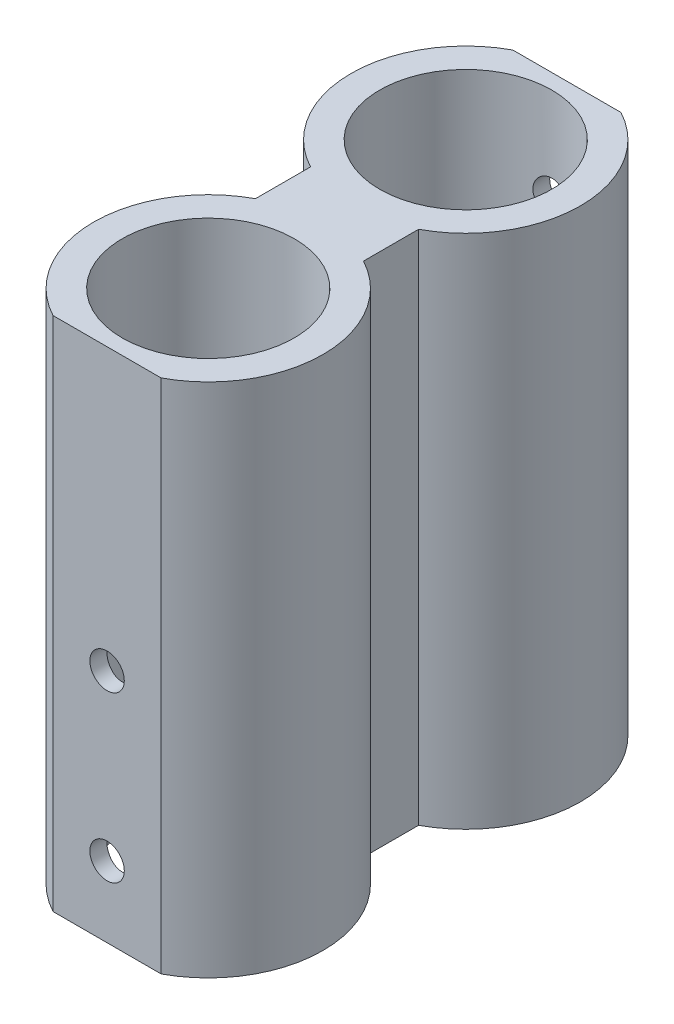
ISO-10303-21;
HEADER;
FILE_DESCRIPTION(('STEP AP214'),'2;1');
FILE_NAME('part.step','',(''),(''),'','','');
FILE_SCHEMA(('AUTOMOTIVE_DESIGN { 1 0 10303 214 1 1 1 1 }'));
ENDSEC;
DATA;
#1=APPLICATION_CONTEXT('core data for automotive mechanical design processes');
#2=APPLICATION_PROTOCOL_DEFINITION('international standard','automotive_design',2000,#1);
#3=PRODUCT_CONTEXT('',#1,'mechanical');
#4=PRODUCT('Part','Part','',(#3));
#5=PRODUCT_RELATED_PRODUCT_CATEGORY('part','',(#4));
#6=PRODUCT_DEFINITION_FORMATION('','',#4);
#7=PRODUCT_DEFINITION_CONTEXT('part definition',#1,'design');
#8=PRODUCT_DEFINITION('design','',#6,#7);
#9=PRODUCT_DEFINITION_SHAPE('','',#8);
#10=(LENGTH_UNIT() NAMED_UNIT(*) SI_UNIT(.MILLI.,.METRE.));
#11=(NAMED_UNIT(*) PLANE_ANGLE_UNIT() SI_UNIT($,.RADIAN.));
#12=(NAMED_UNIT(*) SI_UNIT($,.STERADIAN.) SOLID_ANGLE_UNIT());
#13=UNCERTAINTY_MEASURE_WITH_UNIT(LENGTH_MEASURE(1.E-05),#10,'distance_accuracy_value','');
#14=(GEOMETRIC_REPRESENTATION_CONTEXT(3) GLOBAL_UNCERTAINTY_ASSIGNED_CONTEXT((#13)) GLOBAL_UNIT_ASSIGNED_CONTEXT((#10,
#11,#12)) REPRESENTATION_CONTEXT('',''));
#15=CARTESIAN_POINT('',(0.,0.,0.));
#16=DIRECTION('',(0.,0.,1.));
#17=DIRECTION('',(1.,0.,0.));
#18=AXIS2_PLACEMENT_3D('',#15,#16,#17);
#19=CARTESIAN_POINT('',(0.,45.,0.));
#20=DIRECTION('',(0.,-1.,0.));
#21=DIRECTION('',(0.,0.,-1.));
#22=AXIS2_PLACEMENT_3D('',#19,#20,#21);
#23=CYLINDRICAL_SURFACE('',#22,10.);
#24=CARTESIAN_POINT('',(0.,0.,0.));
#25=DIRECTION('',(0.,1.,0.));
#26=DIRECTION('',(0.,0.,1.));
#27=AXIS2_PLACEMENT_3D('',#24,#25,#26);
#28=CIRCLE('',#27,10.);
#29=CARTESIAN_POINT('',(4.71094618747117,0.,8.82082683305544));
#30=VERTEX_POINT('',#29);
#31=CARTESIAN_POINT('',(4.71094618747117,0.,-8.82082683305544));
#32=VERTEX_POINT('',#31);
#33=EDGE_CURVE('E150',#30,#32,#28,.T.);
#34=ORIENTED_EDGE('',*,*,#33,.T.);
#35=DIRECTION('',(0.,-1.,0.));
#36=VECTOR('',#35,1.);
#37=CARTESIAN_POINT('',(4.71094618747117,45.,-8.82082683305544));
#38=LINE('',#37,#36);
#39=CARTESIAN_POINT('',(4.71094618747117,45.,-8.82082683305544));
#40=VERTEX_POINT('',#39);
#41=EDGE_CURVE('E11',#40,#32,#38,.T.);
#42=ORIENTED_EDGE('',*,*,#41,.F.);
#43=CARTESIAN_POINT('',(0.,45.,0.));
#44=DIRECTION('',(0.,1.,0.));
#45=DIRECTION('',(0.,0.,1.));
#46=AXIS2_PLACEMENT_3D('',#43,#44,#45);
#47=CIRCLE('',#46,10.);
#48=CARTESIAN_POINT('',(4.71094618747117,45.,8.82082683305544));
#49=VERTEX_POINT('',#48);
#50=EDGE_CURVE('E173',#49,#40,#47,.T.);
#51=ORIENTED_EDGE('',*,*,#50,.F.);
#52=DIRECTION('',(0.,-1.,0.));
#53=VECTOR('',#52,1.);
#54=CARTESIAN_POINT('',(4.71094618747117,45.,8.82082683305544));
#55=LINE('',#54,#53);
#56=EDGE_CURVE('E146',#49,#30,#55,.T.);
#57=ORIENTED_EDGE('',*,*,#56,.T.);
#58=EDGE_LOOP('',(#34,#42,#51,#57));
#59=FACE_BOUND('',#58,.T.);
#60=ADVANCED_FACE('F42',(#59),#23,.T.);
#61=CARTESIAN_POINT('',(-4.71094618747118,45.,-8.82082683305543));
#62=DIRECTION('',(0.,0.,1.));
#63=DIRECTION('',(1.,0.,0.));
#64=AXIS2_PLACEMENT_3D('',#61,#62,#63);
#65=PLANE('',#64);
#66=CARTESIAN_POINT('',(0.,36.8523920653444,-8.82082683305544));
#67=DIRECTION('',(0.,0.,-1.));
#68=DIRECTION('',(-1.,0.,0.));
#69=AXIS2_PLACEMENT_3D('',#66,#67,#68);
#70=CIRCLE('',#69,1.5);
#71=CARTESIAN_POINT('',(-1.5,36.8523920653444,-8.82082683305544));
#72=VERTEX_POINT('',#71);
#73=EDGE_CURVE('E279',#72,#72,#70,.T.);
#74=ORIENTED_EDGE('',*,*,#73,.F.);
#75=EDGE_LOOP('',(#74));
#76=FACE_BOUND('',#75,.T.);
#77=DIRECTION('',(-1.,0.,0.));
#78=VECTOR('',#77,1.);
#79=CARTESIAN_POINT('',(-4.71094618747118,0.,-8.82082683305543));
#80=LINE('',#79,#78);
#81=CARTESIAN_POINT('',(-4.71094618747118,0.,-8.82082683305543));
#82=VERTEX_POINT('',#81);
#83=EDGE_CURVE('E154',#32,#82,#80,.T.);
#84=ORIENTED_EDGE('',*,*,#83,.T.);
#85=DIRECTION('',(0.,-1.,0.));
#86=VECTOR('',#85,1.);
#87=CARTESIAN_POINT('',(-4.71094618747118,45.,-8.82082683305543));
#88=LINE('',#87,#86);
#89=CARTESIAN_POINT('',(-4.71094618747118,45.,-8.82082683305543));
#90=VERTEX_POINT('',#89);
#91=EDGE_CURVE('E57',#90,#82,#88,.T.);
#92=ORIENTED_EDGE('',*,*,#91,.F.);
#93=DIRECTION('',(-1.,0.,0.));
#94=VECTOR('',#93,1.);
#95=CARTESIAN_POINT('',(-4.71094618747118,45.,-8.82082683305543));
#96=LINE('',#95,#94);
#97=EDGE_CURVE('E109',#40,#90,#96,.T.);
#98=ORIENTED_EDGE('',*,*,#97,.F.);
#99=ORIENTED_EDGE('',*,*,#41,.T.);
#100=EDGE_LOOP('',(#84,#92,#98,#99));
#101=FACE_BOUND('',#100,.T.);
#102=ADVANCED_FACE('F236',(#76,#101),#65,.F.);
#103=CARTESIAN_POINT('',(0.,45.,0.));
#104=DIRECTION('',(0.,-1.,0.));
#105=DIRECTION('',(0.,0.,-1.));
#106=AXIS2_PLACEMENT_3D('',#103,#104,#105);
#107=CYLINDRICAL_SURFACE('',#106,10.);
#108=CARTESIAN_POINT('',(0.,0.,0.));
#109=DIRECTION('',(0.,1.,0.));
#110=DIRECTION('',(0.,0.,1.));
#111=AXIS2_PLACEMENT_3D('',#108,#109,#110);
#112=CIRCLE('',#111,10.);
#113=CARTESIAN_POINT('',(-4.71094618747117,0.,8.82082683305544));
#114=VERTEX_POINT('',#113);
#115=EDGE_CURVE('E158',#82,#114,#112,.T.);
#116=ORIENTED_EDGE('',*,*,#115,.T.);
#117=DIRECTION('',(0.,-1.,0.));
#118=VECTOR('',#117,1.);
#119=CARTESIAN_POINT('',(-4.71094618747117,45.,8.82082683305544));
#120=LINE('',#119,#118);
#121=CARTESIAN_POINT('',(-4.71094618747117,45.,8.82082683305544));
#122=VERTEX_POINT('',#121);
#123=EDGE_CURVE('E184',#122,#114,#120,.T.);
#124=ORIENTED_EDGE('',*,*,#123,.F.);
#125=CARTESIAN_POINT('',(0.,45.,0.));
#126=DIRECTION('',(0.,1.,0.));
#127=DIRECTION('',(0.,0.,1.));
#128=AXIS2_PLACEMENT_3D('',#125,#126,#127);
#129=CIRCLE('',#128,10.);
#130=EDGE_CURVE('E252',#90,#122,#129,.T.);
#131=ORIENTED_EDGE('',*,*,#130,.F.);
#132=ORIENTED_EDGE('',*,*,#91,.T.);
#133=EDGE_LOOP('',(#116,#124,#131,#132));
#134=FACE_BOUND('',#133,.T.);
#135=ADVANCED_FACE('F241',(#134),#107,.T.);
#136=CARTESIAN_POINT('',(-4.71094618747118,45.,8.82082683305544));
#137=DIRECTION('',(1.,0.,0.));
#138=DIRECTION('',(0.,0.,-1.));
#139=AXIS2_PLACEMENT_3D('',#136,#137,#138);
#140=PLANE('',#139);
#141=DIRECTION('',(0.,0.,1.));
#142=VECTOR('',#141,1.);
#143=CARTESIAN_POINT('',(-4.71094618747118,0.,8.82082683305544));
#144=LINE('',#143,#142);
#145=CARTESIAN_POINT('',(-4.71094618747118,0.,13.6270898336112));
#146=VERTEX_POINT('',#145);
#147=EDGE_CURVE('E161',#114,#146,#144,.T.);
#148=ORIENTED_EDGE('',*,*,#147,.T.);
#149=DIRECTION('',(0.,-1.,0.));
#150=VECTOR('',#149,1.);
#151=CARTESIAN_POINT('',(-4.71094618747118,45.,13.6270898336112));
#152=LINE('',#151,#150);
#153=CARTESIAN_POINT('',(-4.71094618747118,45.,13.6270898336112));
#154=VERTEX_POINT('',#153);
#155=EDGE_CURVE('E180',#154,#146,#152,.T.);
#156=ORIENTED_EDGE('',*,*,#155,.F.);
#157=DIRECTION('',(0.,0.,1.));
#158=VECTOR('',#157,1.);
#159=CARTESIAN_POINT('',(-4.71094618747118,45.,8.82082683305544));
#160=LINE('',#159,#158);
#161=EDGE_CURVE('E255',#122,#154,#160,.T.);
#162=ORIENTED_EDGE('',*,*,#161,.F.);
#163=ORIENTED_EDGE('',*,*,#123,.T.);
#164=EDGE_LOOP('',(#148,#156,#162,#163));
#165=FACE_BOUND('',#164,.T.);
#166=ADVANCED_FACE('F326',(#165),#140,.F.);
#167=CARTESIAN_POINT('',(0.,45.,22.4479166666667));
#168=DIRECTION('',(0.,-1.,0.));
#169=DIRECTION('',(0.,0.,-1.));
#170=AXIS2_PLACEMENT_3D('',#167,#168,#169);
#171=CYLINDRICAL_SURFACE('',#170,10.);
#172=CARTESIAN_POINT('',(0.,0.,22.4479166666667));
#173=DIRECTION('',(0.,1.,0.));
#174=DIRECTION('',(0.,0.,1.));
#175=AXIS2_PLACEMENT_3D('',#172,#173,#174);
#176=CIRCLE('',#175,10.);
#177=CARTESIAN_POINT('',(-4.71094618747118,0.,31.2687434997221));
#178=VERTEX_POINT('',#177);
#179=EDGE_CURVE('E164',#146,#178,#176,.T.);
#180=ORIENTED_EDGE('',*,*,#179,.T.);
#181=DIRECTION('',(0.,-1.,0.));
#182=VECTOR('',#181,1.);
#183=CARTESIAN_POINT('',(-4.71094618747118,45.,31.2687434997221));
#184=LINE('',#183,#182);
#185=CARTESIAN_POINT('',(-4.71094618747118,45.,31.2687434997221));
#186=VERTEX_POINT('',#185);
#187=EDGE_CURVE('E139',#186,#178,#184,.T.);
#188=ORIENTED_EDGE('',*,*,#187,.F.);
#189=CARTESIAN_POINT('',(0.,45.,22.4479166666667));
#190=DIRECTION('',(0.,1.,0.));
#191=DIRECTION('',(0.,0.,1.));
#192=AXIS2_PLACEMENT_3D('',#189,#190,#191);
#193=CIRCLE('',#192,10.);
#194=EDGE_CURVE('E128',#154,#186,#193,.T.);
#195=ORIENTED_EDGE('',*,*,#194,.F.);
#196=ORIENTED_EDGE('',*,*,#155,.T.);
#197=EDGE_LOOP('',(#180,#188,#195,#196));
#198=FACE_BOUND('',#197,.T.);
#199=ADVANCED_FACE('F322',(#198),#171,.T.);
#200=CARTESIAN_POINT('',(-4.71094618747118,45.,31.2687434997221));
#201=DIRECTION('',(0.,0.,-1.));
#202=DIRECTION('',(-1.,0.,0.));
#203=AXIS2_PLACEMENT_3D('',#200,#201,#202);
#204=PLANE('',#203);
#205=CARTESIAN_POINT('',(0.,20.5326938145444,31.2687434997221));
#206=DIRECTION('',(0.,0.,1.));
#207=DIRECTION('',(1.,0.,0.));
#208=AXIS2_PLACEMENT_3D('',#205,#206,#207);
#209=CIRCLE('',#208,1.5);
#210=CARTESIAN_POINT('',(1.5,20.5326938145444,31.2687434997221));
#211=VERTEX_POINT('',#210);
#212=EDGE_CURVE('E208',#211,#211,#209,.T.);
#213=ORIENTED_EDGE('',*,*,#212,.F.);
#214=EDGE_LOOP('',(#213));
#215=FACE_BOUND('',#214,.T.);
#216=CARTESIAN_POINT('',(0.,6.1789456150971,31.2687434997221));
#217=DIRECTION('',(0.,0.,1.));
#218=DIRECTION('',(1.,0.,0.));
#219=AXIS2_PLACEMENT_3D('',#216,#217,#218);
#220=CIRCLE('',#219,1.5);
#221=CARTESIAN_POINT('',(1.5,6.1789456150971,31.2687434997221));
#222=VERTEX_POINT('',#221);
#223=EDGE_CURVE('E272',#222,#222,#220,.T.);
#224=ORIENTED_EDGE('',*,*,#223,.F.);
#225=EDGE_LOOP('',(#224));
#226=FACE_BOUND('',#225,.T.);
#227=DIRECTION('',(1.,0.,0.));
#228=VECTOR('',#227,1.);
#229=CARTESIAN_POINT('',(-4.71094618747118,0.,31.2687434997221));
#230=LINE('',#229,#228);
#231=CARTESIAN_POINT('',(4.71094618747117,0.,31.2687434997221));
#232=VERTEX_POINT('',#231);
#233=EDGE_CURVE('E137',#178,#232,#230,.T.);
#234=ORIENTED_EDGE('',*,*,#233,.T.);
#235=DIRECTION('',(0.,-1.,0.));
#236=VECTOR('',#235,1.);
#237=CARTESIAN_POINT('',(4.71094618747117,45.,31.2687434997221));
#238=LINE('',#237,#236);
#239=CARTESIAN_POINT('',(4.71094618747117,45.,31.2687434997221));
#240=VERTEX_POINT('',#239);
#241=EDGE_CURVE('E134',#240,#232,#238,.T.);
#242=ORIENTED_EDGE('',*,*,#241,.F.);
#243=DIRECTION('',(1.,0.,0.));
#244=VECTOR('',#243,1.);
#245=CARTESIAN_POINT('',(-4.71094618747118,45.,31.2687434997221));
#246=LINE('',#245,#244);
#247=EDGE_CURVE('E122',#186,#240,#246,.T.);
#248=ORIENTED_EDGE('',*,*,#247,.F.);
#249=ORIENTED_EDGE('',*,*,#187,.T.);
#250=EDGE_LOOP('',(#234,#242,#248,#249));
#251=FACE_BOUND('',#250,.T.);
#252=ADVANCED_FACE('F135',(#215,#226,#251),#204,.F.);
#253=CARTESIAN_POINT('',(0.,45.,22.4479166666667));
#254=DIRECTION('',(0.,-1.,0.));
#255=DIRECTION('',(0.,0.,-1.));
#256=AXIS2_PLACEMENT_3D('',#253,#254,#255);
#257=CYLINDRICAL_SURFACE('',#256,10.);
#258=CARTESIAN_POINT('',(0.,0.,22.4479166666667));
#259=DIRECTION('',(0.,1.,0.));
#260=DIRECTION('',(0.,0.,1.));
#261=AXIS2_PLACEMENT_3D('',#258,#259,#260);
#262=CIRCLE('',#261,10.);
#263=CARTESIAN_POINT('',(4.71094618747117,0.,13.6270898336112));
#264=VERTEX_POINT('',#263);
#265=EDGE_CURVE('E95',#232,#264,#262,.T.);
#266=ORIENTED_EDGE('',*,*,#265,.T.);
#267=DIRECTION('',(0.,-1.,0.));
#268=VECTOR('',#267,1.);
#269=CARTESIAN_POINT('',(4.71094618747117,45.,13.6270898336112));
#270=LINE('',#269,#268);
#271=CARTESIAN_POINT('',(4.71094618747117,45.,13.6270898336112));
#272=VERTEX_POINT('',#271);
#273=EDGE_CURVE('E140',#272,#264,#270,.T.);
#274=ORIENTED_EDGE('',*,*,#273,.F.);
#275=CARTESIAN_POINT('',(0.,45.,22.4479166666667));
#276=DIRECTION('',(0.,1.,0.));
#277=DIRECTION('',(0.,0.,1.));
#278=AXIS2_PLACEMENT_3D('',#275,#276,#277);
#279=CIRCLE('',#278,10.);
#280=EDGE_CURVE('E126',#240,#272,#279,.T.);
#281=ORIENTED_EDGE('',*,*,#280,.F.);
#282=ORIENTED_EDGE('',*,*,#241,.T.);
#283=EDGE_LOOP('',(#266,#274,#281,#282));
#284=FACE_BOUND('',#283,.T.);
#285=ADVANCED_FACE('F142',(#284),#257,.T.);
#286=CARTESIAN_POINT('',(4.71094618747117,45.,8.82082683305544));
#287=DIRECTION('',(-1.,0.,0.));
#288=DIRECTION('',(0.,0.,1.));
#289=AXIS2_PLACEMENT_3D('',#286,#287,#288);
#290=PLANE('',#289);
#291=DIRECTION('',(0.,0.,-1.));
#292=VECTOR('',#291,1.);
#293=CARTESIAN_POINT('',(4.71094618747117,0.,8.82082683305544));
#294=LINE('',#293,#292);
#295=EDGE_CURVE('E101',#264,#30,#294,.T.);
#296=ORIENTED_EDGE('',*,*,#295,.T.);
#297=ORIENTED_EDGE('',*,*,#56,.F.);
#298=DIRECTION('',(0.,0.,-1.));
#299=VECTOR('',#298,1.);
#300=CARTESIAN_POINT('',(4.71094618747117,45.,8.82082683305544));
#301=LINE('',#300,#299);
#302=EDGE_CURVE('E66',#272,#49,#301,.T.);
#303=ORIENTED_EDGE('',*,*,#302,.F.);
#304=ORIENTED_EDGE('',*,*,#273,.T.);
#305=EDGE_LOOP('',(#296,#297,#303,#304));
#306=FACE_BOUND('',#305,.T.);
#307=ADVANCED_FACE('F313',(#306),#290,.F.);
#308=CARTESIAN_POINT('',(0.,45.,0.));
#309=DIRECTION('',(0.,1.,0.));
#310=DIRECTION('',(0.,0.,1.));
#311=AXIS2_PLACEMENT_3D('',#308,#309,#310);
#312=PLANE('',#311);
#313=CARTESIAN_POINT('',(0.,45.,0.));
#314=DIRECTION('',(0.,1.,0.));
#315=DIRECTION('',(0.,0.,1.));
#316=AXIS2_PLACEMENT_3D('',#313,#314,#315);
#317=CIRCLE('',#316,7.5);
#318=CARTESIAN_POINT('',(0.,45.,7.5));
#319=VERTEX_POINT('',#318);
#320=EDGE_CURVE('E195',#319,#319,#317,.T.);
#321=ORIENTED_EDGE('',*,*,#320,.F.);
#322=EDGE_LOOP('',(#321));
#323=FACE_BOUND('',#322,.T.);
#324=CARTESIAN_POINT('',(0.,45.,22.4479166666667));
#325=DIRECTION('',(0.,1.,0.));
#326=DIRECTION('',(0.,0.,1.));
#327=AXIS2_PLACEMENT_3D('',#324,#325,#326);
#328=CIRCLE('',#327,7.5);
#329=CARTESIAN_POINT('',(0.,45.,29.9479166666667));
#330=VERTEX_POINT('',#329);
#331=EDGE_CURVE('E265',#330,#330,#328,.T.);
#332=ORIENTED_EDGE('',*,*,#331,.F.);
#333=EDGE_LOOP('',(#332));
#334=FACE_BOUND('',#333,.T.);
#335=ORIENTED_EDGE('',*,*,#50,.T.);
#336=ORIENTED_EDGE('',*,*,#97,.T.);
#337=ORIENTED_EDGE('',*,*,#130,.T.);
#338=ORIENTED_EDGE('',*,*,#161,.T.);
#339=ORIENTED_EDGE('',*,*,#194,.T.);
#340=ORIENTED_EDGE('',*,*,#247,.T.);
#341=ORIENTED_EDGE('',*,*,#280,.T.);
#342=ORIENTED_EDGE('',*,*,#302,.T.);
#343=EDGE_LOOP('',(#335,#336,#337,#338,#339,#340,#341,#342));
#344=FACE_BOUND('',#343,.T.);
#345=ADVANCED_FACE('F124',(#323,#334,#344),#312,.T.);
#346=CARTESIAN_POINT('',(0.,0.,0.));
#347=DIRECTION('',(0.,1.,0.));
#348=DIRECTION('',(0.,0.,1.));
#349=AXIS2_PLACEMENT_3D('',#346,#347,#348);
#350=PLANE('',#349);
#351=CARTESIAN_POINT('',(0.,0.,0.));
#352=DIRECTION('',(0.,1.,0.));
#353=DIRECTION('',(0.,0.,1.));
#354=AXIS2_PLACEMENT_3D('',#351,#352,#353);
#355=CIRCLE('',#354,7.5);
#356=CARTESIAN_POINT('',(0.,0.,7.5));
#357=VERTEX_POINT('',#356);
#358=EDGE_CURVE('E155',#357,#357,#355,.T.);
#359=ORIENTED_EDGE('',*,*,#358,.T.);
#360=EDGE_LOOP('',(#359));
#361=FACE_BOUND('',#360,.T.);
#362=CARTESIAN_POINT('',(0.,0.,22.4479166666667));
#363=DIRECTION('',(0.,1.,0.));
#364=DIRECTION('',(0.,0.,1.));
#365=AXIS2_PLACEMENT_3D('',#362,#363,#364);
#366=CIRCLE('',#365,7.5);
#367=CARTESIAN_POINT('',(0.,0.,29.9479166666667));
#368=VERTEX_POINT('',#367);
#369=EDGE_CURVE('E191',#368,#368,#366,.T.);
#370=ORIENTED_EDGE('',*,*,#369,.T.);
#371=EDGE_LOOP('',(#370));
#372=FACE_BOUND('',#371,.T.);
#373=ORIENTED_EDGE('',*,*,#33,.F.);
#374=ORIENTED_EDGE('',*,*,#295,.F.);
#375=ORIENTED_EDGE('',*,*,#265,.F.);
#376=ORIENTED_EDGE('',*,*,#233,.F.);
#377=ORIENTED_EDGE('',*,*,#179,.F.);
#378=ORIENTED_EDGE('',*,*,#147,.F.);
#379=ORIENTED_EDGE('',*,*,#115,.F.);
#380=ORIENTED_EDGE('',*,*,#83,.F.);
#381=EDGE_LOOP('',(#373,#374,#375,#376,#377,#378,#379,#380));
#382=FACE_BOUND('',#381,.T.);
#383=ADVANCED_FACE('F231',(#361,#372,#382),#350,.F.);
#384=CARTESIAN_POINT('',(0.,-3.,22.4479166666667));
#385=DIRECTION('',(0.,1.,0.));
#386=DIRECTION('',(0.,0.,1.));
#387=AXIS2_PLACEMENT_3D('',#384,#385,#386);
#388=CYLINDRICAL_SURFACE('',#387,7.5);
#389=CARTESIAN_POINT('',(0.,19.0326938145444,29.9479166666667));
#390=CARTESIAN_POINT('',(0.0833653601889497,19.0326968812919,29.9479151303797));
#391=CARTESIAN_POINT('',(0.166769490302283,19.0396670789958,29.9465124443401));
#392=CARTESIAN_POINT('',(0.331220261533529,19.0673415647172,29.9410521510151));
#393=CARTESIAN_POINT('',(0.412264976312033,19.0880567637466,29.9369924345694));
#394=CARTESIAN_POINT('',(0.56959545789497,19.1425557249756,29.9266714058409));
#395=CARTESIAN_POINT('',(0.645885701899702,19.1763269698114,29.9204122028174));
#396=CARTESIAN_POINT('',(0.791711983296339,19.2559421858113,29.9063726371964));
#397=CARTESIAN_POINT('',(0.861248422613717,19.3017854379552,29.8985923652023));
#398=CARTESIAN_POINT('',(0.992540215972296,19.4049015559815,29.8822491466162));
#399=CARTESIAN_POINT('',(1.05419092673779,19.4623063476312,29.8736778492319));
#400=CARTESIAN_POINT('',(1.16705513491204,19.5866324391319,29.8567793734555));
#401=CARTESIAN_POINT('',(1.21826781715564,19.6535544815471,29.848452214173));
#402=CARTESIAN_POINT('',(1.30924763002143,19.7957681040622,29.8329032938559));
#403=CARTESIAN_POINT('',(1.3489064082988,19.8711302802389,29.8256922771408));
#404=CARTESIAN_POINT('',(1.41495849987046,20.0276165430505,29.8133106875429));
#405=CARTESIAN_POINT('',(1.44135312365586,20.1087400595639,29.8081399130961));
#406=CARTESIAN_POINT('',(1.47978794982724,20.2733203604063,29.8005087454497));
#407=CARTESIAN_POINT('',(1.49201174693817,20.3567326307577,29.7980137182745));
#408=CARTESIAN_POINT('',(1.50232819158918,20.5244585465909,29.7959122925761));
#409=CARTESIAN_POINT('',(1.50042228407025,20.6087720990246,29.7963055986843));
#410=CARTESIAN_POINT('',(1.48268185965273,20.7745639965759,29.7999049338894));
#411=CARTESIAN_POINT('',(1.46705781036586,20.8560659229853,29.8030684595481));
#412=CARTESIAN_POINT('',(1.42265682693458,21.0152679295389,29.8117848590667));
#413=CARTESIAN_POINT('',(1.39387926465102,21.0929678279229,29.8173378470333));
#414=CARTESIAN_POINT('',(1.32378717551208,21.2429667070998,29.8302509441728));
#415=CARTESIAN_POINT('',(1.28238922684817,21.3152256338981,29.8376230138722));
#416=CARTESIAN_POINT('',(1.18829036185902,21.4518500895036,29.8533359482626));
#417=CARTESIAN_POINT('',(1.13558814653524,21.5162147098211,29.8616769242421));
#418=CARTESIAN_POINT('',(1.01924990184088,21.6364379182298,29.8785719852886));
#419=CARTESIAN_POINT('',(0.955434241818667,21.6921226663331,29.8871272048302));
#420=CARTESIAN_POINT('',(0.819277536093015,21.7920245839962,29.9033493973828));
#421=CARTESIAN_POINT('',(0.746936381069084,21.8362416064847,29.9110163590013));
#422=CARTESIAN_POINT('',(0.595589080318382,21.9119850783833,29.92461701908));
#423=CARTESIAN_POINT('',(0.516572729377951,21.9434916550112,29.9305479993907));
#424=CARTESIAN_POINT('',(0.354223464672999,21.9927345256022,29.9399878014845));
#425=CARTESIAN_POINT('',(0.270891075108677,22.0104724876548,29.9434969166746));
#426=CARTESIAN_POINT('',(0.103769108440729,22.0314284952358,29.9476567446697));
#427=CARTESIAN_POINT('',(0.020010492488367,22.0348844438548,29.9483542864537));
#428=CARTESIAN_POINT('',(-0.146887401289069,22.0278190261311,29.9469424456182));
#429=CARTESIAN_POINT('',(-0.230026713665688,22.0172984455155,29.9448332207883));
#430=CARTESIAN_POINT('',(-0.39255848991981,21.9827762542284,29.9380741467869));
#431=CARTESIAN_POINT('',(-0.471977922509854,21.9588967117975,29.9334473127297));
#432=CARTESIAN_POINT('',(-0.6256854412495,21.8984678405607,29.9221699475821));
#433=CARTESIAN_POINT('',(-0.699973142456308,21.8619175625291,29.9155192648801));
#434=CARTESIAN_POINT('',(-0.842311760529325,21.7766700785674,29.9008153396661));
#435=CARTESIAN_POINT('',(-0.910275190128281,21.727829642986,29.8927459232224));
#436=CARTESIAN_POINT('',(-1.03712702867881,21.6195800277335,29.8761376891149));
#437=CARTESIAN_POINT('',(-1.09601446339614,21.5601697149446,29.8675988211925));
#438=CARTESIAN_POINT('',(-1.20396088616126,21.4313837867077,29.8508562200211));
#439=CARTESIAN_POINT('',(-1.25285655367298,21.3618701982124,29.8426595701662));
#440=CARTESIAN_POINT('',(-1.33827813007681,21.2154767725094,29.8276795436096));
#441=CARTESIAN_POINT('',(-1.37480453388435,21.1385972301841,29.8208961103668));
#442=CARTESIAN_POINT('',(-1.43422776237294,20.9800414453201,29.8095677754324));
#443=CARTESIAN_POINT('',(-1.45719524968658,20.8983925527289,29.8050112897494));
#444=CARTESIAN_POINT('',(-1.48906297744079,20.732293634308,29.798628218547));
#445=CARTESIAN_POINT('',(-1.49796505233767,20.6478439752304,29.7968012770333));
#446=CARTESIAN_POINT('',(-1.5013813663012,20.4801805177279,29.7961039111373));
#447=CARTESIAN_POINT('',(-1.49615368210634,20.3969720911539,29.7971804545062));
#448=CARTESIAN_POINT('',(-1.47202845615009,20.2326463396868,29.8020502689359));
#449=CARTESIAN_POINT('',(-1.45313102419395,20.1515289980022,29.8058435181742));
#450=CARTESIAN_POINT('',(-1.40231785274843,19.9938522476836,29.815695629954));
#451=CARTESIAN_POINT('',(-1.37043376007602,19.9172822737908,29.8217489819491));
#452=CARTESIAN_POINT('',(-1.29458196690241,19.7705382334427,29.8354423912792));
#453=CARTESIAN_POINT('',(-1.25061325316233,19.7003647039567,29.8430825816501));
#454=CARTESIAN_POINT('',(-1.15095887217962,19.5671204563189,29.859251074515));
#455=CARTESIAN_POINT('',(-1.09508683085277,19.504190666643,29.8677922603121));
#456=CARTESIAN_POINT('',(-0.973596553519712,19.3885145062506,29.884707894746));
#457=CARTESIAN_POINT('',(-0.907976080730003,19.3357704790685,29.8930823046144));
#458=CARTESIAN_POINT('',(-0.76802644363237,19.2414418486247,29.9088241524862));
#459=CARTESIAN_POINT('',(-0.693613326644753,19.1999798096243,29.9161801349553));
#460=CARTESIAN_POINT('',(-0.5387495414111,19.1302146306495,29.9289435429416));
#461=CARTESIAN_POINT('',(-0.45830439129469,19.1018996302456,29.9343527237459));
#462=CARTESIAN_POINT('',(-0.31473223338567,19.0647158924773,29.9415622555972));
#463=CARTESIAN_POINT('',(-0.252422496020677,19.0527290239827,29.9439312140434));
#464=CARTESIAN_POINT('',(-0.1267492878151,19.0367169460068,29.947108978765));
#465=CARTESIAN_POINT('',(-0.0633858506229285,19.0326914827797,29.947917834764));
#466=CARTESIAN_POINT('',(0.,19.0326938145444,29.9479166666667));
#467=B_SPLINE_CURVE_WITH_KNOTS('',3,(#389,#390,#391,#392,#393,#394,#395,#396,#397,#398,#399,
#400,#401,#402,#403,#404,#405,#406,#407,#408,#409,#410,#411,#412,#413,#414,#415,#416,#417,#418,
#419,#420,#421,#422,#423,#424,#425,#426,#427,#428,#429,#430,#431,#432,#433,#434,#435,#436,#437,
#438,#439,#440,#441,#442,#443,#444,#445,#446,#447,#448,#449,#450,#451,#452,#453,#454,#455,#456,
#457,#458,#459,#460,#461,#462,#463,#464,#465,#466),.UNSPECIFIED.,.T.,.F.,(4,2,2,2,2,2,2,2,2,2,2,
2,2,2,2,2,2,2,2,2,2,2,2,2,2,2,2,2,2,2,2,2,2,2,2,2,2,2,4),(0.,0.249864195991887,
0.499926976036984,0.749750602875514,0.999559353346294,1.25239900516828,1.50525839512105,
1.76041792508884,2.01555224047796,2.26734277655381,2.51910756421838,2.76707590509418,
3.01505608880595,3.26471235305389,3.51439732124506,3.76857378737026,4.0227535130973,
4.27732912281036,4.53187388547054,4.78216103514398,5.03243411486801,5.28045680926085,
5.52849808824034,5.77957599050038,6.03068082518895,6.28560942868839,6.540527830852,
6.79410571549085,7.04765052495622,7.29659583851552,7.54553915238913,7.79387941879665,
8.042240513728,8.29482114358715,8.54745981799396,8.80274245013456,9.05779433276278,
9.24778162934841,9.43776287056495),.UNSPECIFIED.);
#468=CARTESIAN_POINT('',(0.,19.0326938145444,29.9479166666667));
#469=VERTEX_POINT('',#468);
#470=EDGE_CURVE('E207',#469,#469,#467,.T.);
#471=ORIENTED_EDGE('',*,*,#470,.T.);
#472=EDGE_LOOP('',(#471));
#473=FACE_BOUND('',#472,.T.);
#474=CARTESIAN_POINT('',(0.,4.6789456150971,29.9479166666667));
#475=CARTESIAN_POINT('',(0.0833653601889498,4.67894868184462,29.9479151303797));
#476=CARTESIAN_POINT('',(0.166769490302284,4.68591887954857,29.9465124443401));
#477=CARTESIAN_POINT('',(0.331220261533529,4.71359336526997,29.9410521510151));
#478=CARTESIAN_POINT('',(0.412264976312034,4.73430856429936,29.9369924345694));
#479=CARTESIAN_POINT('',(0.56959545789497,4.78880752552828,29.9266714058409));
#480=CARTESIAN_POINT('',(0.645885701899702,4.82257877036413,29.9204122028174));
#481=CARTESIAN_POINT('',(0.791711983296339,4.90219398636404,29.9063726371964));
#482=CARTESIAN_POINT('',(0.861248422613718,4.94803723850791,29.8985923652023));
#483=CARTESIAN_POINT('',(0.992540215972298,5.05115335653425,29.8822491466162));
#484=CARTESIAN_POINT('',(1.05419092673779,5.1085581481839,29.8736778492319));
#485=CARTESIAN_POINT('',(1.16705513491204,5.23288423968465,29.8567793734555));
#486=CARTESIAN_POINT('',(1.21826781715564,5.29980628209978,29.848452214173));
#487=CARTESIAN_POINT('',(1.30924763002143,5.44201990461491,29.8329032938559));
#488=CARTESIAN_POINT('',(1.3489064082988,5.51738208079164,29.8256922771408));
#489=CARTESIAN_POINT('',(1.41495849987046,5.67386834360322,29.8133106875429));
#490=CARTESIAN_POINT('',(1.44135312365586,5.75499186011661,29.8081399130961));
#491=CARTESIAN_POINT('',(1.47978794982724,5.91957216095897,29.8005087454497));
#492=CARTESIAN_POINT('',(1.49201174693817,6.00298443131044,29.7980137182745));
#493=CARTESIAN_POINT('',(1.50232819158918,6.17071034714361,29.7959122925761));
#494=CARTESIAN_POINT('',(1.50042228407025,6.25502389957732,29.7963055986843));
#495=CARTESIAN_POINT('',(1.48268185965273,6.4208157971286,29.7999049338894));
#496=CARTESIAN_POINT('',(1.46705781036586,6.50231772353807,29.8030684595481));
#497=CARTESIAN_POINT('',(1.42265682693458,6.6615197300916,29.8117848590667));
#498=CARTESIAN_POINT('',(1.39387926465102,6.73921962847561,29.8173378470333));
#499=CARTESIAN_POINT('',(1.32378717551208,6.8892185076525,29.8302509441728));
#500=CARTESIAN_POINT('',(1.28238922684817,6.96147743445086,29.8376230138722));
#501=CARTESIAN_POINT('',(1.18829036185902,7.09810189005632,29.8533359482626));
#502=CARTESIAN_POINT('',(1.13558814653524,7.16246651037383,29.8616769242421));
#503=CARTESIAN_POINT('',(1.01924990184088,7.2826897187825,29.8785719852886));
#504=CARTESIAN_POINT('',(0.955434241818667,7.33837446688579,29.8871272048302));
#505=CARTESIAN_POINT('',(0.819277536093015,7.43827638454894,29.9033493973828));
#506=CARTESIAN_POINT('',(0.746936381069084,7.48249340703747,29.9110163590013));
#507=CARTESIAN_POINT('',(0.595589080318381,7.55823687893606,29.92461701908));
#508=CARTESIAN_POINT('',(0.51657272937795,7.5897434555639,29.9305479993907));
#509=CARTESIAN_POINT('',(0.354223464672997,7.63898632615495,29.9399878014845));
#510=CARTESIAN_POINT('',(0.270891075108674,7.65672428820754,29.9434969166746));
#511=CARTESIAN_POINT('',(0.103769108440726,7.67768029578851,29.9476567446697));
#512=CARTESIAN_POINT('',(0.0200104924883643,7.6811362444075,29.9483542864537));
#513=CARTESIAN_POINT('',(-0.146887401289071,7.67407082668383,29.9469424456182));
#514=CARTESIAN_POINT('',(-0.23002671366569,7.66355024606821,29.9448332207883));
#515=CARTESIAN_POINT('',(-0.392558489919812,7.62902805478117,29.9380741467869));
#516=CARTESIAN_POINT('',(-0.471977922509855,7.60514851235024,29.9334473127298));
#517=CARTESIAN_POINT('',(-0.625685441249501,7.54471964111338,29.9221699475821));
#518=CARTESIAN_POINT('',(-0.69997314245631,7.50816936308185,29.9155192648801));
#519=CARTESIAN_POINT('',(-0.842311760529327,7.42292187912013,29.9008153396661));
#520=CARTESIAN_POINT('',(-0.910275190128283,7.37408144353868,29.8927459232224));
#521=CARTESIAN_POINT('',(-1.03712702867881,7.26583182828618,29.8761376891149));
#522=CARTESIAN_POINT('',(-1.09601446339614,7.2064215154973,29.8675988211925));
#523=CARTESIAN_POINT('',(-1.20396088616126,7.07763558726041,29.8508562200211));
#524=CARTESIAN_POINT('',(-1.25285655367298,7.00812199876509,29.8426595701662));
#525=CARTESIAN_POINT('',(-1.33827813007681,6.86172857306208,29.8276795436096));
#526=CARTESIAN_POINT('',(-1.37480453388435,6.78484903073677,29.8208961103668));
#527=CARTESIAN_POINT('',(-1.43422776237294,6.62629324587278,29.8095677754324));
#528=CARTESIAN_POINT('',(-1.45719524968658,6.54464435328162,29.8050112897494));
#529=CARTESIAN_POINT('',(-1.48906297744079,6.37854543486074,29.798628218547));
#530=CARTESIAN_POINT('',(-1.49796505233767,6.29409577578308,29.7968012770333));
#531=CARTESIAN_POINT('',(-1.5013813663012,6.12643231828062,29.7961039111373));
#532=CARTESIAN_POINT('',(-1.49615368210634,6.04322389170658,29.7971804545062));
#533=CARTESIAN_POINT('',(-1.47202845615009,5.87889814023956,29.8020502689359));
#534=CARTESIAN_POINT('',(-1.45313102419395,5.79778079855489,29.8058435181742));
#535=CARTESIAN_POINT('',(-1.40231785274843,5.64010404823628,29.815695629954));
#536=CARTESIAN_POINT('',(-1.37043376007602,5.56353407434348,29.8217489819491));
#537=CARTESIAN_POINT('',(-1.29458196690241,5.41679003399544,29.8354423912792));
#538=CARTESIAN_POINT('',(-1.25061325316232,5.34661650450939,29.8430825816501));
#539=CARTESIAN_POINT('',(-1.15095887217962,5.21337225687163,29.859251074515));
#540=CARTESIAN_POINT('',(-1.09508683085277,5.1504424671957,29.8677922603121));
#541=CARTESIAN_POINT('',(-0.973596553519711,5.03476630680334,29.884707894746));
#542=CARTESIAN_POINT('',(-0.907976080730002,4.98202227962119,29.8930823046144));
#543=CARTESIAN_POINT('',(-0.768026443632369,4.88769364917743,29.9088241524862));
#544=CARTESIAN_POINT('',(-0.693613326644751,4.84623161017706,29.9161801349553));
#545=CARTESIAN_POINT('',(-0.538749541411098,4.77646643120221,29.9289435429416));
#546=CARTESIAN_POINT('',(-0.458304391294689,4.74815143079836,29.9343527237459));
#547=CARTESIAN_POINT('',(-0.314732233385669,4.71096769303002,29.9415622555972));
#548=CARTESIAN_POINT('',(-0.252422496020677,4.69898082453546,29.9439312140434));
#549=CARTESIAN_POINT('',(-0.126749287815101,4.68296874655955,29.947108978765));
#550=CARTESIAN_POINT('',(-0.0633858506229286,4.67894328333245,29.947917834764));
#551=CARTESIAN_POINT('',(0.,4.6789456150971,29.9479166666667));
#552=B_SPLINE_CURVE_WITH_KNOTS('',3,(#474,#475,#476,#477,#478,#479,#480,#481,#482,#483,#484,
#485,#486,#487,#488,#489,#490,#491,#492,#493,#494,#495,#496,#497,#498,#499,#500,#501,#502,#503,
#504,#505,#506,#507,#508,#509,#510,#511,#512,#513,#514,#515,#516,#517,#518,#519,#520,#521,#522,
#523,#524,#525,#526,#527,#528,#529,#530,#531,#532,#533,#534,#535,#536,#537,#538,#539,#540,#541,
#542,#543,#544,#545,#546,#547,#548,#549,#550,#551),.UNSPECIFIED.,.T.,.F.,(4,2,2,2,2,2,2,2,2,2,2,
2,2,2,2,2,2,2,2,2,2,2,2,2,2,2,2,2,2,2,2,2,2,2,2,2,2,2,4),(0.,0.249864195991888,
0.499926976036985,0.749750602875513,0.999559353346296,1.25239900516828,1.50525839512105,
1.76041792508884,2.01555224047796,2.26734277655381,2.51910756421838,2.76707590509417,
3.01505608880595,3.26471235305389,3.51439732124506,3.76857378737026,4.0227535130973,
4.27732912281036,4.53187388547054,4.78216103514398,5.03243411486801,5.28045680926085,
5.52849808824034,5.77957599050038,6.03068082518895,6.28560942868839,6.540527830852,
6.79410571549085,7.04765052495622,7.29659583851552,7.54553915238913,7.79387941879665,
8.042240513728,8.29482114358715,8.54745981799396,8.80274245013456,9.05779433276278,
9.24778162934841,9.43776287056494),.UNSPECIFIED.);
#553=CARTESIAN_POINT('',(0.,4.6789456150971,29.9479166666667));
#554=VERTEX_POINT('',#553);
#555=EDGE_CURVE('E199',#554,#554,#552,.T.);
#556=ORIENTED_EDGE('',*,*,#555,.T.);
#557=EDGE_LOOP('',(#556));
#558=FACE_BOUND('',#557,.T.);
#559=ORIENTED_EDGE('',*,*,#331,.T.);
#560=EDGE_LOOP('',(#559));
#561=FACE_BOUND('',#560,.T.);
#562=ORIENTED_EDGE('',*,*,#369,.F.);
#563=EDGE_LOOP('',(#562));
#564=FACE_BOUND('',#563,.T.);
#565=ADVANCED_FACE('F213',(#473,#558,#561,#564),#388,.F.);
#566=CARTESIAN_POINT('',(0.,-3.,0.));
#567=DIRECTION('',(0.,1.,0.));
#568=DIRECTION('',(0.,0.,1.));
#569=AXIS2_PLACEMENT_3D('',#566,#567,#568);
#570=CYLINDRICAL_SURFACE('',#569,7.5);
#571=CARTESIAN_POINT('',(-1.5,36.8523920653444,-7.34846922834953));
#572=CARTESIAN_POINT('',(-1.49999691881235,36.9357386285801,-7.34847088538349));
#573=CARTESIAN_POINT('',(-1.49302975757707,37.0191240003441,-7.34990262402618));
#574=CARTESIAN_POINT('',(-1.46536842537441,37.1835358230593,-7.35546646957746));
#575=CARTESIAN_POINT('',(-1.44466327060578,37.2645603322984,-7.35960073717297));
#576=CARTESIAN_POINT('',(-1.39019367392958,37.4218480203756,-7.37008310582665));
#577=CARTESIAN_POINT('',(-1.35644222122892,37.4981158476432,-7.37642900431582));
#578=CARTESIAN_POINT('',(-1.27687366150577,37.6439043323898,-7.39061699221019));
#579=CARTESIAN_POINT('',(-1.23105722790173,37.7134253661512,-7.398458998102));
#580=CARTESIAN_POINT('',(-1.12796861348015,37.8447335711252,-7.4148794954137));
#581=CARTESIAN_POINT('',(-1.07055848386998,37.9064114471703,-7.42346606755867));
#582=CARTESIAN_POINT('',(-0.946210183531968,38.0193283657128,-7.440337084539));
#583=CARTESIAN_POINT('',(-0.879271345466979,38.0705666764702,-7.44862150816248));
#584=CARTESIAN_POINT('',(-0.737042033886386,38.1615740917871,-7.46404194626342));
#585=CARTESIAN_POINT('',(-0.661683851508318,38.2012393360693,-7.47116732162326));
#586=CARTESIAN_POINT('',(-0.505206225580909,38.2673044709166,-7.48337605325447));
#587=CARTESIAN_POINT('',(-0.424087322130831,38.2937056031959,-7.48845960066179));
#588=CARTESIAN_POINT('',(-0.259525159917743,38.3321528557738,-7.49595481032628));
#589=CARTESIAN_POINT('',(-0.176126608822224,38.3443835317009,-7.4984007943219));
#590=CARTESIAN_POINT('',(-0.00842785265630757,38.3547184931018,-7.50046381775405));
#591=CARTESIAN_POINT('',(0.0758722647477618,38.3528241398131,-7.50008112979138));
#592=CARTESIAN_POINT('',(0.24171300111538,38.335102795021,-7.49655652302773));
#593=CARTESIAN_POINT('',(0.323275821447701,38.3194745995926,-7.49345397548757));
#594=CARTESIAN_POINT('',(0.482597439870448,38.275044516656,-7.48488265739113));
#595=CARTESIAN_POINT('',(0.560356085620691,38.2462421020566,-7.47941379216059));
#596=CARTESIAN_POINT('',(0.710429194801329,38.1760970051235,-7.46665944029938));
#597=CARTESIAN_POINT('',(0.782706261200847,38.134676438687,-7.45936272262835));
#598=CARTESIAN_POINT('',(0.91935756878963,38.0405284494895,-7.44375704210678));
#599=CARTESIAN_POINT('',(0.983730899287498,37.9877997256886,-7.43544796282833));
#600=CARTESIAN_POINT('',(1.10392714658018,37.8714416321817,-7.41856446546689));
#601=CARTESIAN_POINT('',(1.15958147486044,37.80763828525,-7.40998794686274));
#602=CARTESIAN_POINT('',(1.25942773976521,37.6715174016682,-7.39367357398141));
#603=CARTESIAN_POINT('',(1.30361945959162,37.5991997040196,-7.38593573556822));
#604=CARTESIAN_POINT('',(1.37934422220282,37.4478608176117,-7.37217071209386));
#605=CARTESIAN_POINT('',(1.41084997166657,37.3688256138849,-7.36614722345324));
#606=CARTESIAN_POINT('',(1.46008551244137,37.2064350797584,-7.35654714481909));
#607=CARTESIAN_POINT('',(1.47781709918496,37.1230803139157,-7.35297023592642));
#608=CARTESIAN_POINT('',(1.49874900905408,36.9559447783458,-7.34873218901742));
#609=CARTESIAN_POINT('',(1.50219278834687,36.8721957038789,-7.34802220585731));
#610=CARTESIAN_POINT('',(1.49510644246611,36.7053197305448,-7.34946728533281));
#611=CARTESIAN_POINT('',(1.48457710968366,36.6221927966661,-7.35162218550582));
#612=CARTESIAN_POINT('',(1.45005331211124,36.459739104906,-7.35850848742372));
#613=CARTESIAN_POINT('',(1.42618893125895,36.3803835507907,-7.36321498521745));
#614=CARTESIAN_POINT('',(1.36581155296278,36.2267971468013,-7.37465234027497));
#615=CARTESIAN_POINT('',(1.32929751355977,36.1525667196908,-7.38138336429404));
#616=CARTESIAN_POINT('',(1.2441062133234,36.0102724004191,-7.39622108943059));
#617=CARTESIAN_POINT('',(1.19527661697413,35.9423014958931,-7.40434457797355));
#618=CARTESIAN_POINT('',(1.08704335831907,35.815429597343,-7.42100585739955));
#619=CARTESIAN_POINT('',(1.02763860771681,35.7565295379705,-7.42954369085727));
#620=CARTESIAN_POINT('',(0.898848410246839,35.648548226566,-7.44623018803823));
#621=CARTESIAN_POINT('',(0.829323748394448,35.5996315833694,-7.45437086563026));
#622=CARTESIAN_POINT('',(0.682901844952136,35.514173243095,-7.4692069144293));
#623=CARTESIAN_POINT('',(0.606004913150264,35.4776310263272,-7.47590234632816));
#624=CARTESIAN_POINT('',(0.447454021236023,35.4181987577244,-7.487059410916));
#625=CARTESIAN_POINT('',(0.365830010217121,35.395231288005,-7.49153368713906));
#626=CARTESIAN_POINT('',(0.199784182019873,35.3633551938486,-7.4977985390649));
#627=CARTESIAN_POINT('',(0.115362703066825,35.3544448761308,-7.49958943799765));
#628=CARTESIAN_POINT('',(-0.0523093408554308,35.3510015939,-7.50027810681181));
#629=CARTESIAN_POINT('',(-0.135554718212249,35.35622114466,-7.49922567824026));
#630=CARTESIAN_POINT('',(-0.299956546973458,35.3803429911661,-7.49445065340477));
#631=CARTESIAN_POINT('',(-0.381113024630533,35.3992451148665,-7.49072809071528));
#632=CARTESIAN_POINT('',(-0.53887912461764,35.4500855534818,-7.481032475475));
#633=CARTESIAN_POINT('',(-0.615498664860416,35.4819941325411,-7.47506455871866));
#634=CARTESIAN_POINT('',(-0.762331830278924,35.5579104273407,-7.46152083185077));
#635=CARTESIAN_POINT('',(-0.832544948651114,35.6019190991999,-7.45394489468828));
#636=CARTESIAN_POINT('',(-0.965795835159533,35.7016211459375,-7.43786398736791));
#637=CARTESIAN_POINT('',(-1.02869957417475,35.7574915699245,-7.4293460013317));
#638=CARTESIAN_POINT('',(-1.14432392663527,35.878967425488,-7.41241834355477));
#639=CARTESIAN_POINT('',(-1.19704212480408,35.9445751595474,-7.40400869794476));
#640=CARTESIAN_POINT('',(-1.29133832918279,36.0845110403947,-7.3881501412478));
#641=CARTESIAN_POINT('',(-1.33279022195961,36.1589255070851,-7.38071255446371));
#642=CARTESIAN_POINT('',(-1.40253607393175,36.3137912252938,-7.36777855777287));
#643=CARTESIAN_POINT('',(-1.43084196896908,36.3942369233907,-7.36228038807748));
#644=CARTESIAN_POINT('',(-1.4680037097813,36.5377857484996,-7.3549452169166));
#645=CARTESIAN_POINT('',(-1.47998084778413,36.6000701946128,-7.35253177367824));
#646=CARTESIAN_POINT('',(-1.49598002694097,36.7256929971735,-7.34929317692711));
#647=CARTESIAN_POINT('',(-1.50000234234439,36.7890313172118,-7.34846796865858));
#648=CARTESIAN_POINT('',(-1.5,36.8523920653444,-7.34846922834953));
#649=B_SPLINE_CURVE_WITH_KNOTS('',3,(#571,#572,#573,#574,#575,#576,#577,#578,#579,#580,#581,
#582,#583,#584,#585,#586,#587,#588,#589,#590,#591,#592,#593,#594,#595,#596,#597,#598,#599,#600,
#601,#602,#603,#604,#605,#606,#607,#608,#609,#610,#611,#612,#613,#614,#615,#616,#617,#618,#619,
#620,#621,#622,#623,#624,#625,#626,#627,#628,#629,#630,#631,#632,#633,#634,#635,#636,#637,#638,
#639,#640,#641,#642,#643,#644,#645,#646,#647,#648),.UNSPECIFIED.,.T.,.F.,(4,2,2,2,2,2,2,2,2,2,2,
2,2,2,2,2,2,2,2,2,2,2,2,2,2,2,2,2,2,2,2,2,2,2,2,2,2,2,4),(0.,0.249807695804135,
0.499815358926442,0.749574746910876,0.999320197289795,1.25223378822655,1.50516510053133,
1.76030100656175,2.0154130236984,2.2671637332462,2.51889018174372,2.76703184450306,
3.01518343610625,3.26489886333455,3.51464303655099,3.76874020143725,4.0228421718408,
4.27748794759165,4.53210052524037,4.7823563670689,5.03259801792632,5.28044012674977,
5.52830265531597,5.77939589661781,6.03051499305313,6.28548902600176,6.54045234945157,
6.79394720367975,7.04741152037441,7.29646526122028,7.54551587050134,7.79400025613177,
8.04250428202026,8.29501728038395,8.54759008334671,8.80288347868562,9.05794462633399,
9.24785705455343,9.43776293526322),.UNSPECIFIED.);
#650=CARTESIAN_POINT('',(-1.5,36.8523920653444,-7.34846922834953));
#651=VERTEX_POINT('',#650);
#652=EDGE_CURVE('E45',#651,#651,#649,.T.);
#653=ORIENTED_EDGE('',*,*,#652,.T.);
#654=EDGE_LOOP('',(#653));
#655=FACE_BOUND('',#654,.T.);
#656=ORIENTED_EDGE('',*,*,#320,.T.);
#657=EDGE_LOOP('',(#656));
#658=FACE_BOUND('',#657,.T.);
#659=ORIENTED_EDGE('',*,*,#358,.F.);
#660=EDGE_LOOP('',(#659));
#661=FACE_BOUND('',#660,.T.);
#662=ADVANCED_FACE('F220',(#655,#658,#661),#570,.F.);
#663=CARTESIAN_POINT('',(0.,6.1789456150971,26.2687434997221));
#664=DIRECTION('',(0.,0.,1.));
#665=DIRECTION('',(1.,0.,0.));
#666=AXIS2_PLACEMENT_3D('',#663,#664,#665);
#667=CYLINDRICAL_SURFACE('',#666,1.5);
#668=ORIENTED_EDGE('',*,*,#223,.T.);
#669=EDGE_LOOP('',(#668));
#670=FACE_BOUND('',#669,.T.);
#671=ORIENTED_EDGE('',*,*,#555,.F.);
#672=EDGE_LOOP('',(#671));
#673=FACE_BOUND('',#672,.T.);
#674=ADVANCED_FACE('F216',(#670,#673),#667,.F.);
#675=CARTESIAN_POINT('',(0.,20.5326938145444,26.2687434997221));
#676=DIRECTION('',(0.,0.,1.));
#677=DIRECTION('',(1.,0.,0.));
#678=AXIS2_PLACEMENT_3D('',#675,#676,#677);
#679=CYLINDRICAL_SURFACE('',#678,1.5);
#680=ORIENTED_EDGE('',*,*,#212,.T.);
#681=EDGE_LOOP('',(#680));
#682=FACE_BOUND('',#681,.T.);
#683=ORIENTED_EDGE('',*,*,#470,.F.);
#684=EDGE_LOOP('',(#683));
#685=FACE_BOUND('',#684,.T.);
#686=ADVANCED_FACE('F219',(#682,#685),#679,.F.);
#687=CARTESIAN_POINT('',(0.,36.8523920653444,1.17917316694456));
#688=DIRECTION('',(0.,0.,-1.));
#689=DIRECTION('',(-1.,0.,0.));
#690=AXIS2_PLACEMENT_3D('',#687,#688,#689);
#691=CYLINDRICAL_SURFACE('',#690,1.5);
#692=ORIENTED_EDGE('',*,*,#73,.T.);
#693=EDGE_LOOP('',(#692));
#694=FACE_BOUND('',#693,.T.);
#695=ORIENTED_EDGE('',*,*,#652,.F.);
#696=EDGE_LOOP('',(#695));
#697=FACE_BOUND('',#696,.T.);
#698=ADVANCED_FACE('F287',(#694,#697),#691,.F.);
#699=CLOSED_SHELL('',(#60,#102,#135,#166,#199,#252,#285,#307,#345,#383,#565,#662,#674,#686,#698));
#700=MANIFOLD_SOLID_BREP('B2',#699);
#701=ADVANCED_BREP_SHAPE_REPRESENTATION('',(#18,#700),#14);
#702=SHAPE_DEFINITION_REPRESENTATION(#9,#701);
ENDSEC;
END-ISO-10303-21;
